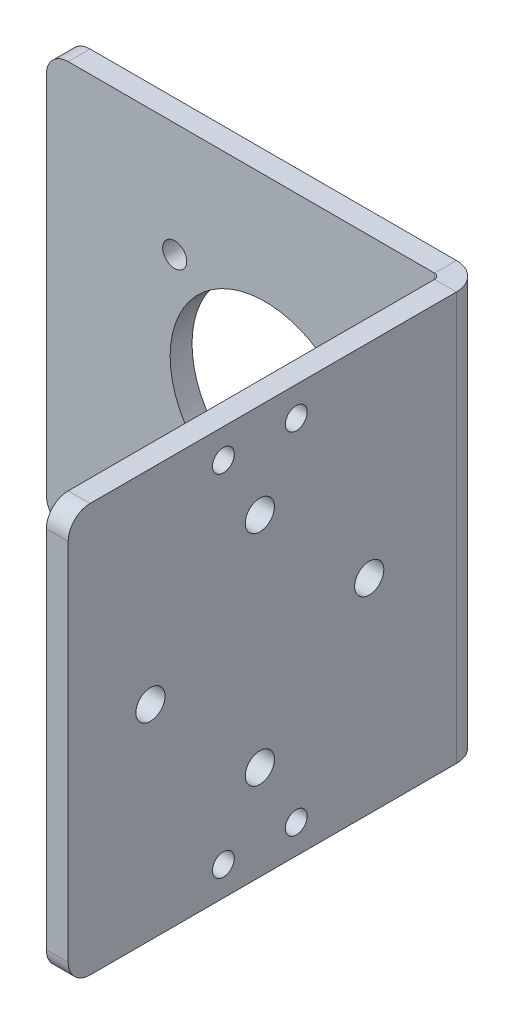
ISO-10303-21;
HEADER;
FILE_DESCRIPTION(('STEP AP214'),'2;1');
FILE_NAME('part.step','',(''),(''),'','','');
FILE_SCHEMA(('AUTOMOTIVE_DESIGN { 1 0 10303 214 1 1 1 1 }'));
ENDSEC;
DATA;
#1=APPLICATION_CONTEXT('core data for automotive mechanical design processes');
#2=APPLICATION_PROTOCOL_DEFINITION('international standard','automotive_design',2000,#1);
#3=PRODUCT_CONTEXT('',#1,'mechanical');
#4=PRODUCT('Part','Part','',(#3));
#5=PRODUCT_RELATED_PRODUCT_CATEGORY('part','',(#4));
#6=PRODUCT_DEFINITION_FORMATION('','',#4);
#7=PRODUCT_DEFINITION_CONTEXT('part definition',#1,'design');
#8=PRODUCT_DEFINITION('design','',#6,#7);
#9=PRODUCT_DEFINITION_SHAPE('','',#8);
#10=(LENGTH_UNIT() NAMED_UNIT(*) SI_UNIT(.MILLI.,.METRE.));
#11=(NAMED_UNIT(*) PLANE_ANGLE_UNIT() SI_UNIT($,.RADIAN.));
#12=(NAMED_UNIT(*) SI_UNIT($,.STERADIAN.) SOLID_ANGLE_UNIT());
#13=UNCERTAINTY_MEASURE_WITH_UNIT(LENGTH_MEASURE(1.E-05),#10,'distance_accuracy_value','');
#14=(GEOMETRIC_REPRESENTATION_CONTEXT(3) GLOBAL_UNCERTAINTY_ASSIGNED_CONTEXT((#13)) GLOBAL_UNIT_ASSIGNED_CONTEXT((#10,
#11,#12)) REPRESENTATION_CONTEXT('',''));
#15=CARTESIAN_POINT('',(0.,0.,0.));
#16=DIRECTION('',(0.,0.,1.));
#17=DIRECTION('',(1.,0.,0.));
#18=AXIS2_PLACEMENT_3D('',#15,#16,#17);
#19=CARTESIAN_POINT('',(-1.02002153225473,0.,-1.02002153225473));
#20=DIRECTION('',(1.,0.,0.));
#21=DIRECTION('',(0.,0.,-1.));
#22=AXIS2_PLACEMENT_3D('',#19,#20,#21);
#23=PLANE('',#22);
#24=CARTESIAN_POINT('',(-1.02002153225485,-24.,32.7000000000002));
#25=DIRECTION('',(1.,0.,0.));
#26=DIRECTION('',(0.,0.,-1.));
#27=AXIS2_PLACEMENT_3D('',#24,#25,#26);
#28=CIRCLE('',#27,1.5);
#29=CARTESIAN_POINT('',(-1.02002153225484,-24.,31.2000000000002));
#30=VERTEX_POINT('',#29);
#31=EDGE_CURVE('E333',#30,#30,#28,.F.);
#32=ORIENTED_EDGE('',*,*,#31,.F.);
#33=EDGE_LOOP('',(#32));
#34=FACE_BOUND('',#33,.T.);
#35=CARTESIAN_POINT('',(-1.02002153225481,-24.,22.7000000000002));
#36=DIRECTION('',(1.,0.,0.));
#37=DIRECTION('',(0.,0.,-1.));
#38=AXIS2_PLACEMENT_3D('',#35,#36,#37);
#39=CIRCLE('',#38,1.5);
#40=CARTESIAN_POINT('',(-1.02002153225481,-24.,21.2000000000002));
#41=VERTEX_POINT('',#40);
#42=EDGE_CURVE('E338',#41,#41,#39,.F.);
#43=ORIENTED_EDGE('',*,*,#42,.F.);
#44=EDGE_LOOP('',(#43));
#45=FACE_BOUND('',#44,.T.);
#46=CARTESIAN_POINT('',(-1.02002153225485,24.,32.7000000000002));
#47=DIRECTION('',(1.,0.,0.));
#48=DIRECTION('',(0.,0.,-1.));
#49=AXIS2_PLACEMENT_3D('',#46,#47,#48);
#50=CIRCLE('',#49,1.5);
#51=CARTESIAN_POINT('',(-1.02002153225485,24.,31.2000000000002));
#52=VERTEX_POINT('',#51);
#53=EDGE_CURVE('E310',#52,#52,#50,.T.);
#54=ORIENTED_EDGE('',*,*,#53,.T.);
#55=EDGE_LOOP('',(#54));
#56=FACE_BOUND('',#55,.T.);
#57=CARTESIAN_POINT('',(-1.02002153225482,24.,22.7000000000002));
#58=DIRECTION('',(1.,0.,0.));
#59=DIRECTION('',(0.,0.,-1.));
#60=AXIS2_PLACEMENT_3D('',#57,#58,#59);
#61=CIRCLE('',#60,1.5);
#62=CARTESIAN_POINT('',(-1.02002153225481,24.,21.2000000000002));
#63=VERTEX_POINT('',#62);
#64=EDGE_CURVE('E326',#63,#63,#61,.T.);
#65=ORIENTED_EDGE('',*,*,#64,.T.);
#66=EDGE_LOOP('',(#65));
#67=FACE_BOUND('',#66,.T.);
#68=CARTESIAN_POINT('',(-1.02002153225478,0.,12.7000000000002));
#69=DIRECTION('',(-1.,0.,0.));
#70=DIRECTION('',(0.,0.,1.));
#71=AXIS2_PLACEMENT_3D('',#68,#69,#70);
#72=CIRCLE('',#71,2.);
#73=CARTESIAN_POINT('',(-1.02002153225479,0.,14.7000000000002));
#74=VERTEX_POINT('',#73);
#75=EDGE_CURVE('E213',#74,#74,#72,.T.);
#76=ORIENTED_EDGE('',*,*,#75,.F.);
#77=EDGE_LOOP('',(#76));
#78=FACE_BOUND('',#77,.T.);
#79=CARTESIAN_POINT('',(-1.02002153225488,0.,42.7000000000002));
#80=DIRECTION('',(-1.,0.,0.));
#81=DIRECTION('',(0.,0.,1.));
#82=AXIS2_PLACEMENT_3D('',#79,#80,#81);
#83=CIRCLE('',#82,2.);
#84=CARTESIAN_POINT('',(-1.02002153225489,0.,44.7000000000002));
#85=VERTEX_POINT('',#84);
#86=EDGE_CURVE('E289',#85,#85,#83,.T.);
#87=ORIENTED_EDGE('',*,*,#86,.F.);
#88=EDGE_LOOP('',(#87));
#89=FACE_BOUND('',#88,.T.);
#90=CARTESIAN_POINT('',(-1.02002153225483,15.,27.7000000000002));
#91=DIRECTION('',(-1.,0.,0.));
#92=DIRECTION('',(0.,0.,1.));
#93=AXIS2_PLACEMENT_3D('',#90,#91,#92);
#94=CIRCLE('',#93,2.);
#95=CARTESIAN_POINT('',(-1.02002153225484,15.,29.7000000000002));
#96=VERTEX_POINT('',#95);
#97=EDGE_CURVE('E285',#96,#96,#94,.T.);
#98=ORIENTED_EDGE('',*,*,#97,.F.);
#99=EDGE_LOOP('',(#98));
#100=FACE_BOUND('',#99,.T.);
#101=CARTESIAN_POINT('',(-1.02002153225483,-15.,27.7000000000002));
#102=DIRECTION('',(-1.,0.,0.));
#103=DIRECTION('',(0.,0.,1.));
#104=AXIS2_PLACEMENT_3D('',#101,#102,#103);
#105=CIRCLE('',#104,2.);
#106=CARTESIAN_POINT('',(-1.02002153225484,-15.,29.7000000000002));
#107=VERTEX_POINT('',#106);
#108=EDGE_CURVE('E282',#107,#107,#105,.T.);
#109=ORIENTED_EDGE('',*,*,#108,.F.);
#110=EDGE_LOOP('',(#109));
#111=FACE_BOUND('',#110,.T.);
#112=DIRECTION('',(0.,0.,1.));
#113=VECTOR('',#112,1.);
#114=CARTESIAN_POINT('',(-1.02002153225454,-28.,-56.0200215322547));
#115=LINE('',#114,#113);
#116=CARTESIAN_POINT('',(-1.02002153225473,-28.,0.736600000000003));
#117=VERTEX_POINT('',#116);
#118=CARTESIAN_POINT('',(-1.02002153225491,-28.,50.9799784677453));
#119=VERTEX_POINT('',#118);
#120=EDGE_CURVE('E187',#117,#119,#115,.T.);
#121=ORIENTED_EDGE('',*,*,#120,.T.);
#122=CARTESIAN_POINT('',(-1.02002153225491,-25.,50.9799784677453));
#123=DIRECTION('',(1.,0.,0.));
#124=DIRECTION('',(0.,0.,-1.));
#125=AXIS2_PLACEMENT_3D('',#122,#123,#124);
#126=CIRCLE('',#125,3.);
#127=CARTESIAN_POINT('',(-1.02002153225492,-25.,53.9799784677453));
#128=VERTEX_POINT('',#127);
#129=EDGE_CURVE('E227',#119,#128,#126,.F.);
#130=ORIENTED_EDGE('',*,*,#129,.T.);
#131=DIRECTION('',(0.,1.,0.));
#132=VECTOR('',#131,1.);
#133=CARTESIAN_POINT('',(-1.02002153225492,-28.,53.9799784677453));
#134=LINE('',#133,#132);
#135=CARTESIAN_POINT('',(-1.02002153225493,25.,53.9799784677453));
#136=VERTEX_POINT('',#135);
#137=EDGE_CURVE('E188',#128,#136,#134,.T.);
#138=ORIENTED_EDGE('',*,*,#137,.T.);
#139=CARTESIAN_POINT('',(-1.02002153225492,25.,50.9799784677453));
#140=DIRECTION('',(1.,0.,0.));
#141=DIRECTION('',(0.,0.,-1.));
#142=AXIS2_PLACEMENT_3D('',#139,#140,#141);
#143=CIRCLE('',#142,3.);
#144=CARTESIAN_POINT('',(-1.02002153225492,28.,50.9799784677453));
#145=VERTEX_POINT('',#144);
#146=EDGE_CURVE('E225',#136,#145,#143,.F.);
#147=ORIENTED_EDGE('',*,*,#146,.T.);
#148=DIRECTION('',(0.,0.,-1.));
#149=VECTOR('',#148,1.);
#150=CARTESIAN_POINT('',(-1.02002153225454,28.,-56.0200215322547));
#151=LINE('',#150,#149);
#152=CARTESIAN_POINT('',(-1.02002153225474,28.,0.73660000000001));
#153=VERTEX_POINT('',#152);
#154=EDGE_CURVE('E191',#145,#153,#151,.T.);
#155=ORIENTED_EDGE('',*,*,#154,.T.);
#156=DIRECTION('',(0.,-1.,0.));
#157=VECTOR('',#156,1.);
#158=CARTESIAN_POINT('',(-1.02002153225474,0.,0.736600000000007));
#159=LINE('',#158,#157);
#160=EDGE_CURVE('E196',#153,#117,#159,.T.);
#161=ORIENTED_EDGE('',*,*,#160,.T.);
#162=EDGE_LOOP('',(#121,#130,#138,#147,#155,#161));
#163=FACE_BOUND('',#162,.T.);
#164=ADVANCED_FACE('F57',(#34,#45,#56,#67,#78,#89,#100,#111,#163),#23,.F.);
#165=CARTESIAN_POINT('',(1.97997846774508,-28.,53.9799784677453));
#166=DIRECTION('',(0.,0.,1.));
#167=DIRECTION('',(1.,0.,0.));
#168=AXIS2_PLACEMENT_3D('',#165,#166,#167);
#169=PLANE('',#168);
#170=ORIENTED_EDGE('',*,*,#137,.F.);
#171=DIRECTION('',(-1.,0.,0.));
#172=VECTOR('',#171,1.);
#173=CARTESIAN_POINT('',(1.97997846774508,-25.,53.9799784677453));
#174=LINE('',#173,#172);
#175=CARTESIAN_POINT('',(1.97997846774508,-25.,53.9799784677453));
#176=VERTEX_POINT('',#175);
#177=EDGE_CURVE('E232',#128,#176,#174,.F.);
#178=ORIENTED_EDGE('',*,*,#177,.T.);
#179=DIRECTION('',(0.,1.,0.));
#180=VECTOR('',#179,1.);
#181=CARTESIAN_POINT('',(1.97997846774508,-28.,53.9799784677453));
#182=LINE('',#181,#180);
#183=CARTESIAN_POINT('',(1.97997846774507,25.,53.9799784677453));
#184=VERTEX_POINT('',#183);
#185=EDGE_CURVE('E183',#176,#184,#182,.T.);
#186=ORIENTED_EDGE('',*,*,#185,.T.);
#187=DIRECTION('',(-1.,0.,0.));
#188=VECTOR('',#187,1.);
#189=CARTESIAN_POINT('',(1.97997846774507,25.,53.9799784677453));
#190=LINE('',#189,#188);
#191=EDGE_CURVE('E229',#184,#136,#190,.T.);
#192=ORIENTED_EDGE('',*,*,#191,.T.);
#193=EDGE_LOOP('',(#170,#178,#186,#192));
#194=FACE_BOUND('',#193,.T.);
#195=ADVANCED_FACE('F360',(#194),#169,.T.);
#196=CARTESIAN_POINT('',(1.97997846774546,-28.,-56.0200215322547));
#197=DIRECTION('',(0.,-1.,0.));
#198=DIRECTION('',(1.,0.,0.));
#199=AXIS2_PLACEMENT_3D('',#196,#197,#198);
#200=PLANE('',#199);
#201=DIRECTION('',(0.,0.,1.));
#202=VECTOR('',#201,1.);
#203=CARTESIAN_POINT('',(1.97997846774546,-28.,-56.0200215322547));
#204=LINE('',#203,#202);
#205=CARTESIAN_POINT('',(1.97997846774527,-28.,0.736600000000012));
#206=VERTEX_POINT('',#205);
#207=CARTESIAN_POINT('',(1.97997846774509,-28.,50.9799784677453));
#208=VERTEX_POINT('',#207);
#209=EDGE_CURVE('E194',#206,#208,#204,.T.);
#210=ORIENTED_EDGE('',*,*,#209,.T.);
#211=DIRECTION('',(-1.,0.,0.));
#212=VECTOR('',#211,1.);
#213=CARTESIAN_POINT('',(1.97997846774509,-28.,50.9799784677453));
#214=LINE('',#213,#212);
#215=EDGE_CURVE('E202',#208,#119,#214,.T.);
#216=ORIENTED_EDGE('',*,*,#215,.T.);
#217=ORIENTED_EDGE('',*,*,#120,.F.);
#218=DIRECTION('',(-1.,0.,0.));
#219=VECTOR('',#218,1.);
#220=CARTESIAN_POINT('',(1.97997846774527,-28.,0.73660000000002));
#221=LINE('',#220,#219);
#222=EDGE_CURVE('E193',#206,#117,#221,.T.);
#223=ORIENTED_EDGE('',*,*,#222,.F.);
#224=EDGE_LOOP('',(#210,#216,#217,#223));
#225=FACE_BOUND('',#224,.T.);
#226=ADVANCED_FACE('F379',(#225),#200,.T.);
#227=CARTESIAN_POINT('',(1.97997846774546,28.,-56.0200215322547));
#228=DIRECTION('',(0.,1.,0.));
#229=DIRECTION('',(-1.,0.,0.));
#230=AXIS2_PLACEMENT_3D('',#227,#228,#229);
#231=PLANE('',#230);
#232=ORIENTED_EDGE('',*,*,#154,.F.);
#233=DIRECTION('',(-1.,0.,0.));
#234=VECTOR('',#233,1.);
#235=CARTESIAN_POINT('',(1.97997846774508,28.,50.9799784677453));
#236=LINE('',#235,#234);
#237=CARTESIAN_POINT('',(1.97997846774508,28.,50.9799784677453));
#238=VERTEX_POINT('',#237);
#239=EDGE_CURVE('E238',#145,#238,#236,.F.);
#240=ORIENTED_EDGE('',*,*,#239,.T.);
#241=DIRECTION('',(0.,0.,-1.));
#242=VECTOR('',#241,1.);
#243=CARTESIAN_POINT('',(1.97997846774546,28.,-56.0200215322547));
#244=LINE('',#243,#242);
#245=CARTESIAN_POINT('',(1.97997846774526,28.,0.73660000000002));
#246=VERTEX_POINT('',#245);
#247=EDGE_CURVE('E186',#238,#246,#244,.T.);
#248=ORIENTED_EDGE('',*,*,#247,.T.);
#249=DIRECTION('',(1.,0.,0.));
#250=VECTOR('',#249,1.);
#251=CARTESIAN_POINT('',(1.97997846774526,28.,0.73660000000002));
#252=LINE('',#251,#250);
#253=EDGE_CURVE('E199',#153,#246,#252,.T.);
#254=ORIENTED_EDGE('',*,*,#253,.F.);
#255=EDGE_LOOP('',(#232,#240,#248,#254));
#256=FACE_BOUND('',#255,.T.);
#257=ADVANCED_FACE('F398',(#256),#231,.T.);
#258=CARTESIAN_POINT('',(1.97997846774527,0.,-1.02002153225472));
#259=DIRECTION('',(1.,0.,0.));
#260=DIRECTION('',(0.,0.,-1.));
#261=AXIS2_PLACEMENT_3D('',#258,#259,#260);
#262=PLANE('',#261);
#263=CARTESIAN_POINT('',(1.97997846774515,-24.,32.7000000000002));
#264=DIRECTION('',(-1.,0.,0.));
#265=DIRECTION('',(0.,0.,-1.));
#266=AXIS2_PLACEMENT_3D('',#263,#264,#265);
#267=CIRCLE('',#266,1.5);
#268=CARTESIAN_POINT('',(1.97997846774515,-24.,31.2000000000002));
#269=VERTEX_POINT('',#268);
#270=EDGE_CURVE('E341',#269,#269,#267,.T.);
#271=ORIENTED_EDGE('',*,*,#270,.T.);
#272=EDGE_LOOP('',(#271));
#273=FACE_BOUND('',#272,.T.);
#274=CARTESIAN_POINT('',(1.97997846774518,-24.,22.7000000000002));
#275=DIRECTION('',(-1.,0.,0.));
#276=DIRECTION('',(0.,0.,-1.));
#277=AXIS2_PLACEMENT_3D('',#274,#275,#276);
#278=CIRCLE('',#277,1.5);
#279=CARTESIAN_POINT('',(1.97997846774519,-24.,21.2000000000002));
#280=VERTEX_POINT('',#279);
#281=EDGE_CURVE('E342',#280,#280,#278,.T.);
#282=ORIENTED_EDGE('',*,*,#281,.T.);
#283=EDGE_LOOP('',(#282));
#284=FACE_BOUND('',#283,.T.);
#285=CARTESIAN_POINT('',(1.97997846774515,24.,32.7000000000002));
#286=DIRECTION('',(1.,0.,0.));
#287=DIRECTION('',(0.,0.,-1.));
#288=AXIS2_PLACEMENT_3D('',#285,#286,#287);
#289=CIRCLE('',#288,1.5);
#290=CARTESIAN_POINT('',(1.97997846774515,24.,31.2000000000002));
#291=VERTEX_POINT('',#290);
#292=EDGE_CURVE('E329',#291,#291,#289,.T.);
#293=ORIENTED_EDGE('',*,*,#292,.F.);
#294=EDGE_LOOP('',(#293));
#295=FACE_BOUND('',#294,.T.);
#296=CARTESIAN_POINT('',(1.97997846774518,24.,22.7000000000002));
#297=DIRECTION('',(1.,0.,0.));
#298=DIRECTION('',(0.,0.,-1.));
#299=AXIS2_PLACEMENT_3D('',#296,#297,#298);
#300=CIRCLE('',#299,1.5);
#301=CARTESIAN_POINT('',(1.97997846774519,24.,21.2000000000002));
#302=VERTEX_POINT('',#301);
#303=EDGE_CURVE('E330',#302,#302,#300,.T.);
#304=ORIENTED_EDGE('',*,*,#303,.F.);
#305=EDGE_LOOP('',(#304));
#306=FACE_BOUND('',#305,.T.);
#307=CARTESIAN_POINT('',(1.97997846774522,0.,12.7000000000002));
#308=DIRECTION('',(1.,0.,0.));
#309=DIRECTION('',(0.,0.,-1.));
#310=AXIS2_PLACEMENT_3D('',#307,#308,#309);
#311=CIRCLE('',#310,2.);
#312=CARTESIAN_POINT('',(1.97997846774523,0.,10.7000000000002));
#313=VERTEX_POINT('',#312);
#314=EDGE_CURVE('E219',#313,#313,#311,.T.);
#315=ORIENTED_EDGE('',*,*,#314,.F.);
#316=EDGE_LOOP('',(#315));
#317=FACE_BOUND('',#316,.T.);
#318=CARTESIAN_POINT('',(1.97997846774512,0.,42.7000000000002));
#319=DIRECTION('',(1.,0.,0.));
#320=DIRECTION('',(0.,0.,-1.));
#321=AXIS2_PLACEMENT_3D('',#318,#319,#320);
#322=CIRCLE('',#321,2.);
#323=CARTESIAN_POINT('',(1.97997846774512,0.,40.7000000000002));
#324=VERTEX_POINT('',#323);
#325=EDGE_CURVE('E216',#324,#324,#322,.T.);
#326=ORIENTED_EDGE('',*,*,#325,.F.);
#327=EDGE_LOOP('',(#326));
#328=FACE_BOUND('',#327,.T.);
#329=CARTESIAN_POINT('',(1.97997846774517,15.,27.7000000000002));
#330=DIRECTION('',(1.,0.,0.));
#331=DIRECTION('',(0.,0.,-1.));
#332=AXIS2_PLACEMENT_3D('',#329,#330,#331);
#333=CIRCLE('',#332,2.);
#334=CARTESIAN_POINT('',(1.97997846774517,15.,25.7000000000002));
#335=VERTEX_POINT('',#334);
#336=EDGE_CURVE('E212',#335,#335,#333,.T.);
#337=ORIENTED_EDGE('',*,*,#336,.F.);
#338=EDGE_LOOP('',(#337));
#339=FACE_BOUND('',#338,.T.);
#340=CARTESIAN_POINT('',(1.97997846774517,-15.,27.7000000000002));
#341=DIRECTION('',(1.,0.,0.));
#342=DIRECTION('',(0.,0.,-1.));
#343=AXIS2_PLACEMENT_3D('',#340,#341,#342);
#344=CIRCLE('',#343,2.);
#345=CARTESIAN_POINT('',(1.97997846774518,-15.,25.7000000000002));
#346=VERTEX_POINT('',#345);
#347=EDGE_CURVE('E209',#346,#346,#344,.T.);
#348=ORIENTED_EDGE('',*,*,#347,.F.);
#349=EDGE_LOOP('',(#348));
#350=FACE_BOUND('',#349,.T.);
#351=ORIENTED_EDGE('',*,*,#185,.F.);
#352=CARTESIAN_POINT('',(1.97997846774509,-25.,50.9799784677453));
#353=DIRECTION('',(1.,0.,0.));
#354=DIRECTION('',(0.,0.,-1.));
#355=AXIS2_PLACEMENT_3D('',#352,#353,#354);
#356=CIRCLE('',#355,3.);
#357=EDGE_CURVE('E236',#176,#208,#356,.T.);
#358=ORIENTED_EDGE('',*,*,#357,.T.);
#359=ORIENTED_EDGE('',*,*,#209,.F.);
#360=DIRECTION('',(0.,-1.,0.));
#361=VECTOR('',#360,1.);
#362=CARTESIAN_POINT('',(1.97997846774526,0.,0.736600000000017));
#363=LINE('',#362,#361);
#364=EDGE_CURVE('E169',#246,#206,#363,.T.);
#365=ORIENTED_EDGE('',*,*,#364,.F.);
#366=ORIENTED_EDGE('',*,*,#247,.F.);
#367=CARTESIAN_POINT('',(1.97997846774508,25.,50.9799784677453));
#368=DIRECTION('',(1.,0.,0.));
#369=DIRECTION('',(0.,0.,-1.));
#370=AXIS2_PLACEMENT_3D('',#367,#368,#369);
#371=CIRCLE('',#370,3.);
#372=EDGE_CURVE('E234',#238,#184,#371,.T.);
#373=ORIENTED_EDGE('',*,*,#372,.T.);
#374=EDGE_LOOP('',(#351,#358,#359,#365,#366,#373));
#375=FACE_BOUND('',#374,.T.);
#376=ADVANCED_FACE('F348',(#273,#284,#295,#306,#317,#328,#339,#350,#375),#262,.T.);
#377=CARTESIAN_POINT('',(-55.,-28.,-3.));
#378=DIRECTION('',(-1.,0.,0.));
#379=DIRECTION('',(0.,0.,1.));
#380=AXIS2_PLACEMENT_3D('',#377,#378,#379);
#381=PLANE('',#380);
#382=DIRECTION('',(0.,-1.,0.));
#383=VECTOR('',#382,1.);
#384=CARTESIAN_POINT('',(-55.,-28.,0.));
#385=LINE('',#384,#383);
#386=CARTESIAN_POINT('',(-55.,25.,0.));
#387=VERTEX_POINT('',#386);
#388=CARTESIAN_POINT('',(-55.,-25.,0.));
#389=VERTEX_POINT('',#388);
#390=EDGE_CURVE('E267',#387,#389,#385,.T.);
#391=ORIENTED_EDGE('',*,*,#390,.F.);
#392=DIRECTION('',(0.,0.,1.));
#393=VECTOR('',#392,1.);
#394=CARTESIAN_POINT('',(-55.,25.,-3.));
#395=LINE('',#394,#393);
#396=CARTESIAN_POINT('',(-55.,25.,-3.));
#397=VERTEX_POINT('',#396);
#398=EDGE_CURVE('E250',#387,#397,#395,.F.);
#399=ORIENTED_EDGE('',*,*,#398,.T.);
#400=DIRECTION('',(0.,-1.,0.));
#401=VECTOR('',#400,1.);
#402=CARTESIAN_POINT('',(-55.,-28.,-3.));
#403=LINE('',#402,#401);
#404=CARTESIAN_POINT('',(-55.,-25.,-3.));
#405=VERTEX_POINT('',#404);
#406=EDGE_CURVE('E178',#397,#405,#403,.T.);
#407=ORIENTED_EDGE('',*,*,#406,.T.);
#408=DIRECTION('',(0.,0.,1.));
#409=VECTOR('',#408,1.);
#410=CARTESIAN_POINT('',(-55.,-25.,-3.));
#411=LINE('',#410,#409);
#412=EDGE_CURVE('E247',#405,#389,#411,.T.);
#413=ORIENTED_EDGE('',*,*,#412,.T.);
#414=EDGE_LOOP('',(#391,#399,#407,#413));
#415=FACE_BOUND('',#414,.T.);
#416=ADVANCED_FACE('F270',(#415),#381,.T.);
#417=CARTESIAN_POINT('',(0.,0.,-3.));
#418=DIRECTION('',(0.,0.,-1.));
#419=DIRECTION('',(-1.,0.,0.));
#420=AXIS2_PLACEMENT_3D('',#417,#418,#419);
#421=PLANE('',#420);
#422=CARTESIAN_POINT('',(-37.3943902030196,12.3743686707645,-3.));
#423=DIRECTION('',(0.,0.,1.));
#424=DIRECTION('',(1.,0.,0.));
#425=AXIS2_PLACEMENT_3D('',#422,#423,#424);
#426=CIRCLE('',#425,1.65);
#427=CARTESIAN_POINT('',(-35.7443902030196,12.3743686707645,-3.));
#428=VERTEX_POINT('',#427);
#429=EDGE_CURVE('E306',#428,#428,#426,.T.);
#430=ORIENTED_EDGE('',*,*,#429,.T.);
#431=EDGE_LOOP('',(#430));
#432=FACE_BOUND('',#431,.T.);
#433=CARTESIAN_POINT('',(-37.3943902030194,-12.3743686707646,-3.));
#434=DIRECTION('',(0.,0.,1.));
#435=DIRECTION('',(1.,0.,0.));
#436=AXIS2_PLACEMENT_3D('',#433,#434,#435);
#437=CIRCLE('',#436,1.65);
#438=CARTESIAN_POINT('',(-35.7443902030194,-12.3743686707646,-3.));
#439=VERTEX_POINT('',#438);
#440=EDGE_CURVE('E313',#439,#439,#437,.T.);
#441=ORIENTED_EDGE('',*,*,#440,.T.);
#442=EDGE_LOOP('',(#441));
#443=FACE_BOUND('',#442,.T.);
#444=CARTESIAN_POINT('',(-12.6456528614903,-12.3743686707645,-3.));
#445=DIRECTION('',(0.,0.,1.));
#446=DIRECTION('',(1.,0.,0.));
#447=AXIS2_PLACEMENT_3D('',#444,#445,#446);
#448=CIRCLE('',#447,1.65000000000001);
#449=CARTESIAN_POINT('',(-10.9956528614903,-12.3743686707645,-3.));
#450=VERTEX_POINT('',#449);
#451=EDGE_CURVE('E319',#450,#450,#448,.T.);
#452=ORIENTED_EDGE('',*,*,#451,.T.);
#453=EDGE_LOOP('',(#452));
#454=FACE_BOUND('',#453,.T.);
#455=CARTESIAN_POINT('',(-12.6456528614904,12.3743686707646,-3.));
#456=DIRECTION('',(0.,0.,1.));
#457=DIRECTION('',(1.,0.,0.));
#458=AXIS2_PLACEMENT_3D('',#455,#456,#457);
#459=CIRCLE('',#458,1.65);
#460=CARTESIAN_POINT('',(-10.9956528614904,12.3743686707646,-3.));
#461=VERTEX_POINT('',#460);
#462=EDGE_CURVE('E299',#461,#461,#459,.T.);
#463=ORIENTED_EDGE('',*,*,#462,.T.);
#464=EDGE_LOOP('',(#463));
#465=FACE_BOUND('',#464,.T.);
#466=CARTESIAN_POINT('',(-25.0200215322549,0.,-3.));
#467=DIRECTION('',(0.,0.,-1.));
#468=DIRECTION('',(-1.,0.,0.));
#469=AXIS2_PLACEMENT_3D('',#466,#467,#468);
#470=CIRCLE('',#469,13.);
#471=CARTESIAN_POINT('',(-38.0200215322549,0.,-3.));
#472=VERTEX_POINT('',#471);
#473=EDGE_CURVE('E286',#472,#472,#470,.T.);
#474=ORIENTED_EDGE('',*,*,#473,.F.);
#475=EDGE_LOOP('',(#474));
#476=FACE_BOUND('',#475,.T.);
#477=ORIENTED_EDGE('',*,*,#406,.F.);
#478=CARTESIAN_POINT('',(-52.,25.,-3.));
#479=DIRECTION('',(0.,0.,-1.));
#480=DIRECTION('',(-1.,0.,0.));
#481=AXIS2_PLACEMENT_3D('',#478,#479,#480);
#482=CIRCLE('',#481,3.);
#483=CARTESIAN_POINT('',(-52.,28.,-3.));
#484=VERTEX_POINT('',#483);
#485=EDGE_CURVE('E65',#397,#484,#482,.T.);
#486=ORIENTED_EDGE('',*,*,#485,.T.);
#487=DIRECTION('',(-1.,0.,0.));
#488=VECTOR('',#487,1.);
#489=CARTESIAN_POINT('',(-55.,28.,-3.));
#490=LINE('',#489,#488);
#491=CARTESIAN_POINT('',(-1.75662153225474,28.,-3.));
#492=VERTEX_POINT('',#491);
#493=EDGE_CURVE('E176',#492,#484,#490,.T.);
#494=ORIENTED_EDGE('',*,*,#493,.F.);
#495=DIRECTION('',(0.,-1.,0.));
#496=VECTOR('',#495,1.);
#497=CARTESIAN_POINT('',(-1.75662153225473,0.,-3.));
#498=LINE('',#497,#496);
#499=CARTESIAN_POINT('',(-1.75662153225473,-28.,-3.));
#500=VERTEX_POINT('',#499);
#501=EDGE_CURVE('E149',#492,#500,#498,.T.);
#502=ORIENTED_EDGE('',*,*,#501,.T.);
#503=DIRECTION('',(1.,0.,0.));
#504=VECTOR('',#503,1.);
#505=CARTESIAN_POINT('',(-55.,-28.,-3.));
#506=LINE('',#505,#504);
#507=CARTESIAN_POINT('',(-52.,-28.,-3.));
#508=VERTEX_POINT('',#507);
#509=EDGE_CURVE('E144',#508,#500,#506,.T.);
#510=ORIENTED_EDGE('',*,*,#509,.F.);
#511=CARTESIAN_POINT('',(-52.,-25.,-3.));
#512=DIRECTION('',(0.,0.,-1.));
#513=DIRECTION('',(-1.,0.,0.));
#514=AXIS2_PLACEMENT_3D('',#511,#512,#513);
#515=CIRCLE('',#514,3.);
#516=EDGE_CURVE('E77',#508,#405,#515,.T.);
#517=ORIENTED_EDGE('',*,*,#516,.T.);
#518=EDGE_LOOP('',(#477,#486,#494,#502,#510,#517));
#519=FACE_BOUND('',#518,.T.);
#520=ADVANCED_FACE('F174',(#432,#443,#454,#465,#476,#519),#421,.T.);
#521=CARTESIAN_POINT('',(-55.,-28.,-3.));
#522=DIRECTION('',(0.,-1.,0.));
#523=DIRECTION('',(0.,0.,-1.));
#524=AXIS2_PLACEMENT_3D('',#521,#522,#523);
#525=PLANE('',#524);
#526=DIRECTION('',(1.,0.,0.));
#527=VECTOR('',#526,1.);
#528=CARTESIAN_POINT('',(-55.,-28.,0.));
#529=LINE('',#528,#527);
#530=CARTESIAN_POINT('',(-52.,-28.,0.));
#531=VERTEX_POINT('',#530);
#532=CARTESIAN_POINT('',(-1.75662153225473,-28.,0.));
#533=VERTEX_POINT('',#532);
#534=EDGE_CURVE('E272',#531,#533,#529,.T.);
#535=ORIENTED_EDGE('',*,*,#534,.F.);
#536=DIRECTION('',(0.,0.,1.));
#537=VECTOR('',#536,1.);
#538=CARTESIAN_POINT('',(-52.,-28.,-3.));
#539=LINE('',#538,#537);
#540=EDGE_CURVE('E14',#531,#508,#539,.F.);
#541=ORIENTED_EDGE('',*,*,#540,.T.);
#542=ORIENTED_EDGE('',*,*,#509,.T.);
#543=DIRECTION('',(0.,0.,1.));
#544=VECTOR('',#543,1.);
#545=CARTESIAN_POINT('',(-1.75662153225473,-28.,-3.));
#546=LINE('',#545,#544);
#547=EDGE_CURVE('E147',#500,#533,#546,.T.);
#548=ORIENTED_EDGE('',*,*,#547,.T.);
#549=EDGE_LOOP('',(#535,#541,#542,#548));
#550=FACE_BOUND('',#549,.T.);
#551=ADVANCED_FACE('F146',(#550),#525,.T.);
#552=CARTESIAN_POINT('',(0.,0.,0.));
#553=DIRECTION('',(0.,0.,-1.));
#554=DIRECTION('',(-1.,0.,0.));
#555=AXIS2_PLACEMENT_3D('',#552,#553,#554);
#556=PLANE('',#555);
#557=CARTESIAN_POINT('',(-37.3943902030196,12.3743686707645,0.));
#558=DIRECTION('',(0.,0.,1.));
#559=DIRECTION('',(1.,0.,0.));
#560=AXIS2_PLACEMENT_3D('',#557,#558,#559);
#561=CIRCLE('',#560,1.65);
#562=CARTESIAN_POINT('',(-35.7443902030196,12.3743686707645,0.));
#563=VERTEX_POINT('',#562);
#564=EDGE_CURVE('E309',#563,#563,#561,.T.);
#565=ORIENTED_EDGE('',*,*,#564,.F.);
#566=EDGE_LOOP('',(#565));
#567=FACE_BOUND('',#566,.T.);
#568=CARTESIAN_POINT('',(-37.3943902030194,-12.3743686707646,0.));
#569=DIRECTION('',(0.,0.,1.));
#570=DIRECTION('',(1.,0.,0.));
#571=AXIS2_PLACEMENT_3D('',#568,#569,#570);
#572=CIRCLE('',#571,1.65);
#573=CARTESIAN_POINT('',(-35.7443902030194,-12.3743686707646,0.));
#574=VERTEX_POINT('',#573);
#575=EDGE_CURVE('E316',#574,#574,#572,.T.);
#576=ORIENTED_EDGE('',*,*,#575,.F.);
#577=EDGE_LOOP('',(#576));
#578=FACE_BOUND('',#577,.T.);
#579=CARTESIAN_POINT('',(-12.6456528614903,-12.3743686707645,0.));
#580=DIRECTION('',(0.,0.,1.));
#581=DIRECTION('',(1.,0.,0.));
#582=AXIS2_PLACEMENT_3D('',#579,#580,#581);
#583=CIRCLE('',#582,1.65000000000001);
#584=CARTESIAN_POINT('',(-10.9956528614903,-12.3743686707645,0.));
#585=VERTEX_POINT('',#584);
#586=EDGE_CURVE('E303',#585,#585,#583,.T.);
#587=ORIENTED_EDGE('',*,*,#586,.F.);
#588=EDGE_LOOP('',(#587));
#589=FACE_BOUND('',#588,.T.);
#590=CARTESIAN_POINT('',(-12.6456528614904,12.3743686707646,0.));
#591=DIRECTION('',(0.,0.,1.));
#592=DIRECTION('',(1.,0.,0.));
#593=AXIS2_PLACEMENT_3D('',#590,#591,#592);
#594=CIRCLE('',#593,1.65);
#595=CARTESIAN_POINT('',(-10.9956528614904,12.3743686707646,0.));
#596=VERTEX_POINT('',#595);
#597=EDGE_CURVE('E300',#596,#596,#594,.T.);
#598=ORIENTED_EDGE('',*,*,#597,.F.);
#599=EDGE_LOOP('',(#598));
#600=FACE_BOUND('',#599,.T.);
#601=CARTESIAN_POINT('',(-25.0200215322549,0.,0.));
#602=DIRECTION('',(0.,0.,1.));
#603=DIRECTION('',(1.,0.,0.));
#604=AXIS2_PLACEMENT_3D('',#601,#602,#603);
#605=CIRCLE('',#604,13.);
#606=CARTESIAN_POINT('',(-12.0200215322549,0.,0.));
#607=VERTEX_POINT('',#606);
#608=EDGE_CURVE('E296',#607,#607,#605,.T.);
#609=ORIENTED_EDGE('',*,*,#608,.F.);
#610=EDGE_LOOP('',(#609));
#611=FACE_BOUND('',#610,.T.);
#612=DIRECTION('',(-1.,0.,0.));
#613=VECTOR('',#612,1.);
#614=CARTESIAN_POINT('',(-55.,28.,0.));
#615=LINE('',#614,#613);
#616=CARTESIAN_POINT('',(-1.75662153225474,28.,0.));
#617=VERTEX_POINT('',#616);
#618=CARTESIAN_POINT('',(-52.,28.,0.));
#619=VERTEX_POINT('',#618);
#620=EDGE_CURVE('E161',#617,#619,#615,.T.);
#621=ORIENTED_EDGE('',*,*,#620,.T.);
#622=CARTESIAN_POINT('',(-52.,25.,0.));
#623=DIRECTION('',(0.,0.,-1.));
#624=DIRECTION('',(-1.,0.,0.));
#625=AXIS2_PLACEMENT_3D('',#622,#623,#624);
#626=CIRCLE('',#625,3.);
#627=EDGE_CURVE('E245',#619,#387,#626,.F.);
#628=ORIENTED_EDGE('',*,*,#627,.T.);
#629=ORIENTED_EDGE('',*,*,#390,.T.);
#630=CARTESIAN_POINT('',(-52.,-25.,0.));
#631=DIRECTION('',(0.,0.,-1.));
#632=DIRECTION('',(-1.,0.,0.));
#633=AXIS2_PLACEMENT_3D('',#630,#631,#632);
#634=CIRCLE('',#633,3.);
#635=EDGE_CURVE('E243',#389,#531,#634,.F.);
#636=ORIENTED_EDGE('',*,*,#635,.T.);
#637=ORIENTED_EDGE('',*,*,#534,.T.);
#638=DIRECTION('',(0.,-1.,0.));
#639=VECTOR('',#638,1.);
#640=CARTESIAN_POINT('',(-1.75662153225473,0.,0.));
#641=LINE('',#640,#639);
#642=EDGE_CURVE('E170',#617,#533,#641,.T.);
#643=ORIENTED_EDGE('',*,*,#642,.F.);
#644=EDGE_LOOP('',(#621,#628,#629,#636,#637,#643));
#645=FACE_BOUND('',#644,.T.);
#646=ADVANCED_FACE('F266',(#567,#578,#589,#600,#611,#645),#556,.F.);
#647=CARTESIAN_POINT('',(-55.,28.,-3.));
#648=DIRECTION('',(0.,1.,0.));
#649=DIRECTION('',(0.,0.,1.));
#650=AXIS2_PLACEMENT_3D('',#647,#648,#649);
#651=PLANE('',#650);
#652=ORIENTED_EDGE('',*,*,#493,.T.);
#653=DIRECTION('',(0.,0.,1.));
#654=VECTOR('',#653,1.);
#655=CARTESIAN_POINT('',(-52.,28.,-3.));
#656=LINE('',#655,#654);
#657=EDGE_CURVE('E240',#484,#619,#656,.T.);
#658=ORIENTED_EDGE('',*,*,#657,.T.);
#659=ORIENTED_EDGE('',*,*,#620,.F.);
#660=DIRECTION('',(0.,0.,-1.));
#661=VECTOR('',#660,1.);
#662=CARTESIAN_POINT('',(-1.75662153225474,28.,-3.));
#663=LINE('',#662,#661);
#664=EDGE_CURVE('E260',#617,#492,#663,.T.);
#665=ORIENTED_EDGE('',*,*,#664,.T.);
#666=EDGE_LOOP('',(#652,#658,#659,#665));
#667=FACE_BOUND('',#666,.T.);
#668=ADVANCED_FACE('F257',(#667),#651,.T.);
#669=CARTESIAN_POINT('',(-1.75662153225474,28.,0.7366));
#670=DIRECTION('',(0.,1.,0.));
#671=DIRECTION('',(0.,0.,1.));
#672=AXIS2_PLACEMENT_3D('',#669,#670,#671);
#673=PLANE('',#672);
#674=ORIENTED_EDGE('',*,*,#664,.F.);
#675=CARTESIAN_POINT('',(-1.75662153225474,28.,0.7366));
#676=DIRECTION('',(0.,-1.,0.));
#677=DIRECTION('',(1.,0.,0.));
#678=AXIS2_PLACEMENT_3D('',#675,#676,#677);
#679=CIRCLE('',#678,0.7366);
#680=EDGE_CURVE('E222',#617,#153,#679,.T.);
#681=ORIENTED_EDGE('',*,*,#680,.T.);
#682=ORIENTED_EDGE('',*,*,#253,.T.);
#683=CARTESIAN_POINT('',(-1.75662153225474,28.,0.7366));
#684=DIRECTION('',(0.,-1.,0.));
#685=DIRECTION('',(0.,0.,1.));
#686=AXIS2_PLACEMENT_3D('',#683,#684,#685);
#687=CIRCLE('',#686,3.7366);
#688=EDGE_CURVE('E171',#492,#246,#687,.T.);
#689=ORIENTED_EDGE('',*,*,#688,.F.);
#690=EDGE_LOOP('',(#674,#681,#682,#689));
#691=FACE_BOUND('',#690,.T.);
#692=ADVANCED_FACE('F403',(#691),#673,.T.);
#693=CARTESIAN_POINT('',(-1.75662153225473,-28.,0.7366));
#694=DIRECTION('',(0.,-1.,0.));
#695=DIRECTION('',(0.,0.,-1.));
#696=AXIS2_PLACEMENT_3D('',#693,#694,#695);
#697=PLANE('',#696);
#698=CARTESIAN_POINT('',(-1.75662153225473,-28.,0.7366));
#699=DIRECTION('',(0.,-1.,0.));
#700=DIRECTION('',(1.,0.,0.));
#701=AXIS2_PLACEMENT_3D('',#698,#699,#700);
#702=CIRCLE('',#701,0.7366);
#703=EDGE_CURVE('E159',#117,#533,#702,.F.);
#704=ORIENTED_EDGE('',*,*,#703,.T.);
#705=ORIENTED_EDGE('',*,*,#547,.F.);
#706=CARTESIAN_POINT('',(-1.75662153225473,-28.,0.7366));
#707=DIRECTION('',(0.,1.,0.));
#708=DIRECTION('',(0.,0.,-1.));
#709=AXIS2_PLACEMENT_3D('',#706,#707,#708);
#710=CIRCLE('',#709,3.7366);
#711=EDGE_CURVE('E157',#206,#500,#710,.T.);
#712=ORIENTED_EDGE('',*,*,#711,.F.);
#713=ORIENTED_EDGE('',*,*,#222,.T.);
#714=EDGE_LOOP('',(#704,#705,#712,#713));
#715=FACE_BOUND('',#714,.T.);
#716=ADVANCED_FACE('F155',(#715),#697,.T.);
#717=CARTESIAN_POINT('',(-1.75662153225474,56.1902382699195,0.7366));
#718=DIRECTION('',(0.,-1.,0.));
#719=DIRECTION('',(1.,0.,0.));
#720=AXIS2_PLACEMENT_3D('',#717,#718,#719);
#721=CYLINDRICAL_SURFACE('',#720,3.7366);
#722=ORIENTED_EDGE('',*,*,#364,.T.);
#723=ORIENTED_EDGE('',*,*,#711,.T.);
#724=ORIENTED_EDGE('',*,*,#501,.F.);
#725=ORIENTED_EDGE('',*,*,#688,.T.);
#726=EDGE_LOOP('',(#722,#723,#724,#725));
#727=FACE_BOUND('',#726,.T.);
#728=ADVANCED_FACE('F165',(#727),#721,.T.);
#729=CARTESIAN_POINT('',(-1.75662153225474,56.1902382699195,0.7366));
#730=DIRECTION('',(0.,-1.,0.));
#731=DIRECTION('',(1.,0.,0.));
#732=AXIS2_PLACEMENT_3D('',#729,#730,#731);
#733=CYLINDRICAL_SURFACE('',#732,0.7366);
#734=ORIENTED_EDGE('',*,*,#160,.F.);
#735=ORIENTED_EDGE('',*,*,#680,.F.);
#736=ORIENTED_EDGE('',*,*,#642,.T.);
#737=ORIENTED_EDGE('',*,*,#703,.F.);
#738=EDGE_LOOP('',(#734,#735,#736,#737));
#739=FACE_BOUND('',#738,.T.);
#740=ADVANCED_FACE('F402',(#739),#733,.F.);
#741=CARTESIAN_POINT('',(8.97997846774517,-15.,27.7000000000002));
#742=DIRECTION('',(-1.,0.,0.));
#743=DIRECTION('',(0.,0.,1.));
#744=AXIS2_PLACEMENT_3D('',#741,#742,#743);
#745=CYLINDRICAL_SURFACE('',#744,2.);
#746=ORIENTED_EDGE('',*,*,#347,.T.);
#747=EDGE_LOOP('',(#746));
#748=FACE_BOUND('',#747,.T.);
#749=ORIENTED_EDGE('',*,*,#108,.T.);
#750=EDGE_LOOP('',(#749));
#751=FACE_BOUND('',#750,.T.);
#752=ADVANCED_FACE('F468',(#748,#751),#745,.F.);
#753=CARTESIAN_POINT('',(8.97997846774517,15.,27.7000000000002));
#754=DIRECTION('',(-1.,0.,0.));
#755=DIRECTION('',(0.,0.,1.));
#756=AXIS2_PLACEMENT_3D('',#753,#754,#755);
#757=CYLINDRICAL_SURFACE('',#756,2.);
#758=ORIENTED_EDGE('',*,*,#336,.T.);
#759=EDGE_LOOP('',(#758));
#760=FACE_BOUND('',#759,.T.);
#761=ORIENTED_EDGE('',*,*,#97,.T.);
#762=EDGE_LOOP('',(#761));
#763=FACE_BOUND('',#762,.T.);
#764=ADVANCED_FACE('F464',(#760,#763),#757,.F.);
#765=CARTESIAN_POINT('',(8.97997846774512,0.,42.7000000000002));
#766=DIRECTION('',(-1.,0.,0.));
#767=DIRECTION('',(0.,0.,1.));
#768=AXIS2_PLACEMENT_3D('',#765,#766,#767);
#769=CYLINDRICAL_SURFACE('',#768,2.);
#770=ORIENTED_EDGE('',*,*,#325,.T.);
#771=EDGE_LOOP('',(#770));
#772=FACE_BOUND('',#771,.T.);
#773=ORIENTED_EDGE('',*,*,#86,.T.);
#774=EDGE_LOOP('',(#773));
#775=FACE_BOUND('',#774,.T.);
#776=ADVANCED_FACE('F460',(#772,#775),#769,.F.);
#777=CARTESIAN_POINT('',(8.97997846774522,0.,12.7000000000002));
#778=DIRECTION('',(-1.,0.,0.));
#779=DIRECTION('',(0.,0.,1.));
#780=AXIS2_PLACEMENT_3D('',#777,#778,#779);
#781=CYLINDRICAL_SURFACE('',#780,2.);
#782=ORIENTED_EDGE('',*,*,#314,.T.);
#783=EDGE_LOOP('',(#782));
#784=FACE_BOUND('',#783,.T.);
#785=ORIENTED_EDGE('',*,*,#75,.T.);
#786=EDGE_LOOP('',(#785));
#787=FACE_BOUND('',#786,.T.);
#788=ADVANCED_FACE('F435',(#784,#787),#781,.F.);
#789=CARTESIAN_POINT('',(1.97997846774509,-25.,50.9799784677453));
#790=DIRECTION('',(-1.,0.,0.));
#791=DIRECTION('',(0.,0.,1.));
#792=AXIS2_PLACEMENT_3D('',#789,#790,#791);
#793=CYLINDRICAL_SURFACE('',#792,3.);
#794=ORIENTED_EDGE('',*,*,#357,.F.);
#795=ORIENTED_EDGE('',*,*,#177,.F.);
#796=ORIENTED_EDGE('',*,*,#129,.F.);
#797=ORIENTED_EDGE('',*,*,#215,.F.);
#798=EDGE_LOOP('',(#794,#795,#796,#797));
#799=FACE_BOUND('',#798,.T.);
#800=ADVANCED_FACE('F384',(#799),#793,.T.);
#801=CARTESIAN_POINT('',(1.97997846774508,25.,50.9799784677453));
#802=DIRECTION('',(-1.,0.,0.));
#803=DIRECTION('',(0.,0.,1.));
#804=AXIS2_PLACEMENT_3D('',#801,#802,#803);
#805=CYLINDRICAL_SURFACE('',#804,3.);
#806=ORIENTED_EDGE('',*,*,#372,.F.);
#807=ORIENTED_EDGE('',*,*,#239,.F.);
#808=ORIENTED_EDGE('',*,*,#146,.F.);
#809=ORIENTED_EDGE('',*,*,#191,.F.);
#810=EDGE_LOOP('',(#806,#807,#808,#809));
#811=FACE_BOUND('',#810,.T.);
#812=ADVANCED_FACE('F394',(#811),#805,.T.);
#813=CARTESIAN_POINT('',(-52.,25.,-3.));
#814=DIRECTION('',(0.,0.,1.));
#815=DIRECTION('',(1.,0.,0.));
#816=AXIS2_PLACEMENT_3D('',#813,#814,#815);
#817=CYLINDRICAL_SURFACE('',#816,3.);
#818=ORIENTED_EDGE('',*,*,#485,.F.);
#819=ORIENTED_EDGE('',*,*,#398,.F.);
#820=ORIENTED_EDGE('',*,*,#627,.F.);
#821=ORIENTED_EDGE('',*,*,#657,.F.);
#822=EDGE_LOOP('',(#818,#819,#820,#821));
#823=FACE_BOUND('',#822,.T.);
#824=ADVANCED_FACE('F262',(#823),#817,.T.);
#825=CARTESIAN_POINT('',(-52.,-25.,-3.));
#826=DIRECTION('',(0.,0.,1.));
#827=DIRECTION('',(1.,0.,0.));
#828=AXIS2_PLACEMENT_3D('',#825,#826,#827);
#829=CYLINDRICAL_SURFACE('',#828,3.);
#830=ORIENTED_EDGE('',*,*,#516,.F.);
#831=ORIENTED_EDGE('',*,*,#540,.F.);
#832=ORIENTED_EDGE('',*,*,#635,.F.);
#833=ORIENTED_EDGE('',*,*,#412,.F.);
#834=EDGE_LOOP('',(#830,#831,#832,#833));
#835=FACE_BOUND('',#834,.T.);
#836=ADVANCED_FACE('F59',(#835),#829,.T.);
#837=CARTESIAN_POINT('',(-25.0200215322549,0.,-10.));
#838=DIRECTION('',(0.,0.,1.));
#839=DIRECTION('',(1.,0.,0.));
#840=AXIS2_PLACEMENT_3D('',#837,#838,#839);
#841=CYLINDRICAL_SURFACE('',#840,13.);
#842=ORIENTED_EDGE('',*,*,#473,.T.);
#843=EDGE_LOOP('',(#842));
#844=FACE_BOUND('',#843,.T.);
#845=ORIENTED_EDGE('',*,*,#608,.T.);
#846=EDGE_LOOP('',(#845));
#847=FACE_BOUND('',#846,.T.);
#848=ADVANCED_FACE('F441',(#844,#847),#841,.F.);
#849=CARTESIAN_POINT('',(-12.6456528614904,12.3743686707646,-3.));
#850=DIRECTION('',(0.,0.,1.));
#851=DIRECTION('',(1.,0.,0.));
#852=AXIS2_PLACEMENT_3D('',#849,#850,#851);
#853=CYLINDRICAL_SURFACE('',#852,1.65);
#854=ORIENTED_EDGE('',*,*,#462,.F.);
#855=EDGE_LOOP('',(#854));
#856=FACE_BOUND('',#855,.T.);
#857=ORIENTED_EDGE('',*,*,#597,.T.);
#858=EDGE_LOOP('',(#857));
#859=FACE_BOUND('',#858,.T.);
#860=ADVANCED_FACE('F446',(#856,#859),#853,.F.);
#861=CARTESIAN_POINT('',(-12.6456528614903,-12.3743686707645,-3.));
#862=DIRECTION('',(0.,0.,1.));
#863=DIRECTION('',(1.,0.,0.));
#864=AXIS2_PLACEMENT_3D('',#861,#862,#863);
#865=CYLINDRICAL_SURFACE('',#864,1.65000000000001);
#866=ORIENTED_EDGE('',*,*,#451,.F.);
#867=EDGE_LOOP('',(#866));
#868=FACE_BOUND('',#867,.T.);
#869=ORIENTED_EDGE('',*,*,#586,.T.);
#870=EDGE_LOOP('',(#869));
#871=FACE_BOUND('',#870,.T.);
#872=ADVANCED_FACE('F452',(#868,#871),#865,.F.);
#873=CARTESIAN_POINT('',(-37.3943902030194,-12.3743686707646,-3.));
#874=DIRECTION('',(0.,0.,1.));
#875=DIRECTION('',(1.,0.,0.));
#876=AXIS2_PLACEMENT_3D('',#873,#874,#875);
#877=CYLINDRICAL_SURFACE('',#876,1.65);
#878=ORIENTED_EDGE('',*,*,#440,.F.);
#879=EDGE_LOOP('',(#878));
#880=FACE_BOUND('',#879,.T.);
#881=ORIENTED_EDGE('',*,*,#575,.T.);
#882=EDGE_LOOP('',(#881));
#883=FACE_BOUND('',#882,.T.);
#884=ADVANCED_FACE('F550',(#880,#883),#877,.F.);
#885=CARTESIAN_POINT('',(-37.3943902030196,12.3743686707645,-3.));
#886=DIRECTION('',(0.,0.,1.));
#887=DIRECTION('',(1.,0.,0.));
#888=AXIS2_PLACEMENT_3D('',#885,#886,#887);
#889=CYLINDRICAL_SURFACE('',#888,1.65);
#890=ORIENTED_EDGE('',*,*,#429,.F.);
#891=EDGE_LOOP('',(#890));
#892=FACE_BOUND('',#891,.T.);
#893=ORIENTED_EDGE('',*,*,#564,.T.);
#894=EDGE_LOOP('',(#893));
#895=FACE_BOUND('',#894,.T.);
#896=ADVANCED_FACE('F561',(#892,#895),#889,.F.);
#897=CARTESIAN_POINT('',(-8.02002153225482,24.,22.7000000000002));
#898=DIRECTION('',(1.,0.,0.));
#899=DIRECTION('',(0.,0.,-1.));
#900=AXIS2_PLACEMENT_3D('',#897,#898,#899);
#901=CYLINDRICAL_SURFACE('',#900,1.5);
#902=ORIENTED_EDGE('',*,*,#303,.T.);
#903=EDGE_LOOP('',(#902));
#904=FACE_BOUND('',#903,.T.);
#905=ORIENTED_EDGE('',*,*,#64,.F.);
#906=EDGE_LOOP('',(#905));
#907=FACE_BOUND('',#906,.T.);
#908=ADVANCED_FACE('F572',(#904,#907),#901,.F.);
#909=CARTESIAN_POINT('',(-8.02002153225485,24.,32.7000000000002));
#910=DIRECTION('',(1.,0.,0.));
#911=DIRECTION('',(0.,0.,-1.));
#912=AXIS2_PLACEMENT_3D('',#909,#910,#911);
#913=CYLINDRICAL_SURFACE('',#912,1.5);
#914=ORIENTED_EDGE('',*,*,#292,.T.);
#915=EDGE_LOOP('',(#914));
#916=FACE_BOUND('',#915,.T.);
#917=ORIENTED_EDGE('',*,*,#53,.F.);
#918=EDGE_LOOP('',(#917));
#919=FACE_BOUND('',#918,.T.);
#920=ADVANCED_FACE('F582',(#916,#919),#913,.F.);
#921=CARTESIAN_POINT('',(-8.02002153225482,-24.,22.7000000000002));
#922=DIRECTION('',(1.,0.,0.));
#923=DIRECTION('',(0.,0.,-1.));
#924=AXIS2_PLACEMENT_3D('',#921,#922,#923);
#925=CYLINDRICAL_SURFACE('',#924,1.5);
#926=ORIENTED_EDGE('',*,*,#281,.F.);
#927=EDGE_LOOP('',(#926));
#928=FACE_BOUND('',#927,.T.);
#929=ORIENTED_EDGE('',*,*,#42,.T.);
#930=EDGE_LOOP('',(#929));
#931=FACE_BOUND('',#930,.T.);
#932=ADVANCED_FACE('F354',(#928,#931),#925,.F.);
#933=CARTESIAN_POINT('',(-8.02002153225485,-24.,32.7000000000002));
#934=DIRECTION('',(1.,0.,0.));
#935=DIRECTION('',(0.,0.,-1.));
#936=AXIS2_PLACEMENT_3D('',#933,#934,#935);
#937=CYLINDRICAL_SURFACE('',#936,1.5);
#938=ORIENTED_EDGE('',*,*,#270,.F.);
#939=EDGE_LOOP('',(#938));
#940=FACE_BOUND('',#939,.T.);
#941=ORIENTED_EDGE('',*,*,#31,.T.);
#942=EDGE_LOOP('',(#941));
#943=FACE_BOUND('',#942,.T.);
#944=ADVANCED_FACE('F351',(#940,#943),#937,.F.);
#945=CLOSED_SHELL('',(#164,#195,#226,#257,#376,#416,#520,#551,#646,#668,#692,#716,#728,#740,
#752,#764,#776,#788,#800,#812,#824,#836,#848,#860,#872,#884,#896,#908,#920,#932,#944));
#946=MANIFOLD_SOLID_BREP('B2',#945);
#947=ADVANCED_BREP_SHAPE_REPRESENTATION('',(#18,#946),#14);
#948=SHAPE_DEFINITION_REPRESENTATION(#9,#947);
ENDSEC;
END-ISO-10303-21;
